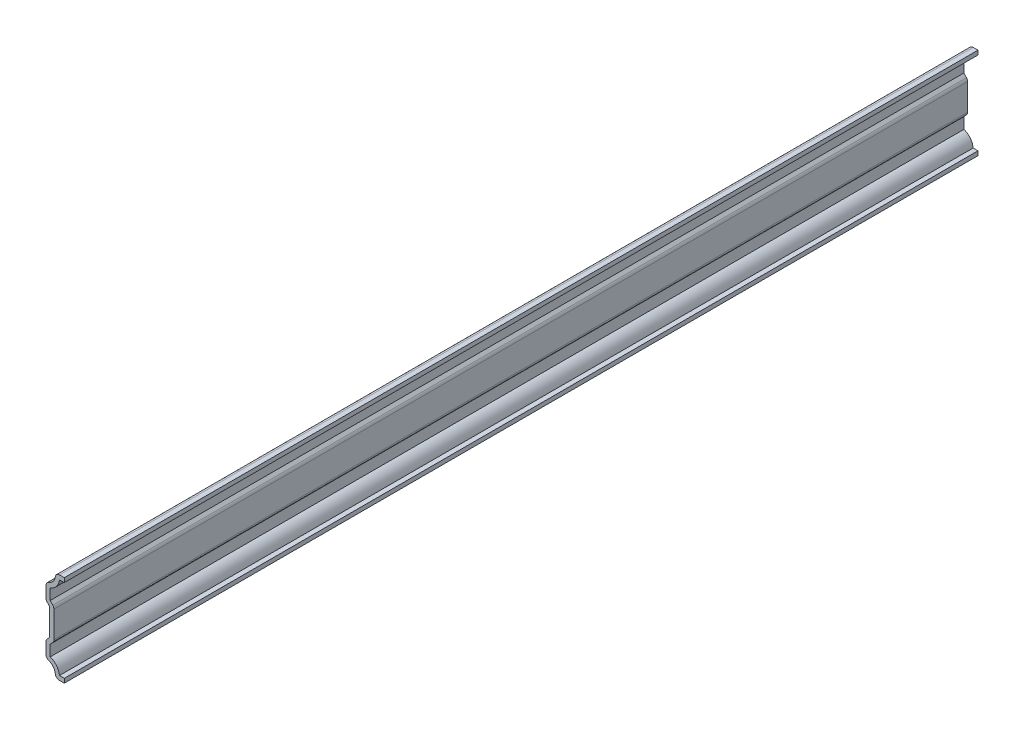
ISO-10303-21;
HEADER;
FILE_DESCRIPTION(('STEP AP214'),'2;1');
FILE_NAME('part.step','',(''),(''),'','','');
FILE_SCHEMA(('AUTOMOTIVE_DESIGN { 1 0 10303 214 1 1 1 1 }'));
ENDSEC;
DATA;
#1=APPLICATION_CONTEXT('core data for automotive mechanical design processes');
#2=APPLICATION_PROTOCOL_DEFINITION('international standard','automotive_design',2000,#1);
#3=PRODUCT_CONTEXT('',#1,'mechanical');
#4=PRODUCT('Part','Part','',(#3));
#5=PRODUCT_RELATED_PRODUCT_CATEGORY('part','',(#4));
#6=PRODUCT_DEFINITION_FORMATION('','',#4);
#7=PRODUCT_DEFINITION_CONTEXT('part definition',#1,'design');
#8=PRODUCT_DEFINITION('design','',#6,#7);
#9=PRODUCT_DEFINITION_SHAPE('','',#8);
#10=(LENGTH_UNIT() NAMED_UNIT(*) SI_UNIT(.MILLI.,.METRE.));
#11=(NAMED_UNIT(*) PLANE_ANGLE_UNIT() SI_UNIT($,.RADIAN.));
#12=(NAMED_UNIT(*) SI_UNIT($,.STERADIAN.) SOLID_ANGLE_UNIT());
#13=UNCERTAINTY_MEASURE_WITH_UNIT(LENGTH_MEASURE(1.E-05),#10,'distance_accuracy_value','');
#14=(GEOMETRIC_REPRESENTATION_CONTEXT(3) GLOBAL_UNCERTAINTY_ASSIGNED_CONTEXT((#13)) GLOBAL_UNIT_ASSIGNED_CONTEXT((#10,
#11,#12)) REPRESENTATION_CONTEXT('',''));
#15=CARTESIAN_POINT('',(0.,0.,0.));
#16=DIRECTION('',(0.,0.,1.));
#17=DIRECTION('',(1.,0.,0.));
#18=AXIS2_PLACEMENT_3D('',#15,#16,#17);
#19=CARTESIAN_POINT('',(0.,0.,-357.1875));
#20=DIRECTION('',(0.,-1.,0.));
#21=DIRECTION('',(0.,0.,-1.));
#22=AXIS2_PLACEMENT_3D('',#19,#20,#21);
#23=PLANE('',#22);
#24=DIRECTION('',(1.,0.,0.));
#25=VECTOR('',#24,1.);
#26=CARTESIAN_POINT('',(0.,0.,0.));
#27=LINE('',#26,#25);
#28=CARTESIAN_POINT('',(-1.88974825091168,0.,0.));
#29=VERTEX_POINT('',#28);
#30=CARTESIAN_POINT('',(0.,0.,0.));
#31=VERTEX_POINT('',#30);
#32=EDGE_CURVE('E394',#29,#31,#27,.T.);
#33=ORIENTED_EDGE('',*,*,#32,.F.);
#34=DIRECTION('',(0.,0.,1.));
#35=VECTOR('',#34,1.);
#36=CARTESIAN_POINT('',(-1.88974825091168,0.,-357.1875));
#37=LINE('',#36,#35);
#38=CARTESIAN_POINT('',(-1.88974825091168,0.,-357.1875));
#39=VERTEX_POINT('',#38);
#40=EDGE_CURVE('E229',#29,#39,#37,.F.);
#41=ORIENTED_EDGE('',*,*,#40,.T.);
#42=DIRECTION('',(1.,0.,0.));
#43=VECTOR('',#42,1.);
#44=CARTESIAN_POINT('',(0.,0.,-357.1875));
#45=LINE('',#44,#43);
#46=CARTESIAN_POINT('',(0.,0.,-357.1875));
#47=VERTEX_POINT('',#46);
#48=EDGE_CURVE('E222',#39,#47,#45,.T.);
#49=ORIENTED_EDGE('',*,*,#48,.T.);
#50=DIRECTION('',(0.,0.,1.));
#51=VECTOR('',#50,1.);
#52=CARTESIAN_POINT('',(0.,0.,-357.1875));
#53=LINE('',#52,#51);
#54=EDGE_CURVE('E226',#47,#31,#53,.T.);
#55=ORIENTED_EDGE('',*,*,#54,.T.);
#56=EDGE_LOOP('',(#33,#41,#49,#55));
#57=FACE_BOUND('',#56,.T.);
#58=ADVANCED_FACE('F35',(#57),#23,.T.);
#59=CARTESIAN_POINT('',(-7.14375,1.13413615439127,-357.1875));
#60=DIRECTION('',(0.,0.,1.));
#61=DIRECTION('',(1.,0.,0.));
#62=AXIS2_PLACEMENT_3D('',#59,#60,#61);
#63=CYLINDRICAL_SURFACE('',#62,3.62836384560873);
#64=CARTESIAN_POINT('',(-7.14375,1.13413615439127,-357.1875));
#65=DIRECTION('',(0.,0.,-1.));
#66=DIRECTION('',(1.,0.,0.));
#67=AXIS2_PLACEMENT_3D('',#64,#65,#66);
#68=CIRCLE('',#67,3.62836384560873);
#69=CARTESIAN_POINT('',(-6.00906239666636,4.58051225675757,-357.1875));
#70=VERTEX_POINT('',#69);
#71=CARTESIAN_POINT('',(-3.53281683671486,1.48936268269144,-357.1875));
#72=VERTEX_POINT('',#71);
#73=EDGE_CURVE('E246',#70,#72,#68,.T.);
#74=ORIENTED_EDGE('',*,*,#73,.T.);
#75=DIRECTION('',(0.,0.,1.));
#76=VECTOR('',#75,1.);
#77=CARTESIAN_POINT('',(-3.53281683671486,1.48936268269144,-357.1875));
#78=LINE('',#77,#76);
#79=CARTESIAN_POINT('',(-3.53281683671486,1.48936268269144,0.));
#80=VERTEX_POINT('',#79);
#81=EDGE_CURVE('E257',#72,#80,#78,.T.);
#82=ORIENTED_EDGE('',*,*,#81,.T.);
#83=CARTESIAN_POINT('',(-7.14375,1.13413615439127,0.));
#84=DIRECTION('',(0.,0.,-1.));
#85=DIRECTION('',(1.,0.,0.));
#86=AXIS2_PLACEMENT_3D('',#83,#84,#85);
#87=CIRCLE('',#86,3.62836384560873);
#88=CARTESIAN_POINT('',(-6.00906239666636,4.58051225675757,0.));
#89=VERTEX_POINT('',#88);
#90=EDGE_CURVE('E232',#89,#80,#87,.T.);
#91=ORIENTED_EDGE('',*,*,#90,.F.);
#92=DIRECTION('',(0.,0.,1.));
#93=VECTOR('',#92,1.);
#94=CARTESIAN_POINT('',(-6.00906239666636,4.58051225675757,-357.1875));
#95=LINE('',#94,#93);
#96=EDGE_CURVE('E255',#89,#70,#95,.F.);
#97=ORIENTED_EDGE('',*,*,#96,.T.);
#98=EDGE_LOOP('',(#74,#82,#91,#97));
#99=FACE_BOUND('',#98,.T.);
#100=ADVANCED_FACE('F470',(#99),#63,.F.);
#101=CARTESIAN_POINT('',(-7.14375,4.7625,-357.1875));
#102=DIRECTION('',(-1.,0.,0.));
#103=DIRECTION('',(0.,0.,1.));
#104=AXIS2_PLACEMENT_3D('',#101,#102,#103);
#105=PLANE('',#104);
#106=DIRECTION('',(0.,-1.,0.));
#107=VECTOR('',#106,1.);
#108=CARTESIAN_POINT('',(-7.14375,4.7625,-357.1875));
#109=LINE('',#108,#107);
#110=CARTESIAN_POINT('',(-7.14375,10.4694360726647,-357.1875));
#111=VERTEX_POINT('',#110);
#112=CARTESIAN_POINT('',(-7.14375,6.14870309624384,-357.1875));
#113=VERTEX_POINT('',#112);
#114=EDGE_CURVE('E251',#111,#113,#109,.T.);
#115=ORIENTED_EDGE('',*,*,#114,.T.);
#116=DIRECTION('',(0.,0.,1.));
#117=VECTOR('',#116,1.);
#118=CARTESIAN_POINT('',(-7.14375,6.14870309624384,-357.1875));
#119=LINE('',#118,#117);
#120=CARTESIAN_POINT('',(-7.14375,6.14870309624384,0.));
#121=VERTEX_POINT('',#120);
#122=EDGE_CURVE('E295',#113,#121,#119,.T.);
#123=ORIENTED_EDGE('',*,*,#122,.T.);
#124=DIRECTION('',(0.,-1.,0.));
#125=VECTOR('',#124,1.);
#126=CARTESIAN_POINT('',(-7.14375,4.7625,0.));
#127=LINE('',#126,#125);
#128=CARTESIAN_POINT('',(-7.14375,10.4694360726647,0.));
#129=VERTEX_POINT('',#128);
#130=EDGE_CURVE('E353',#129,#121,#127,.T.);
#131=ORIENTED_EDGE('',*,*,#130,.F.);
#132=DIRECTION('',(0.,0.,1.));
#133=VECTOR('',#132,1.);
#134=CARTESIAN_POINT('',(-7.14375,10.4694360726647,-357.1875));
#135=LINE('',#134,#133);
#136=EDGE_CURVE('E293',#129,#111,#135,.F.);
#137=ORIENTED_EDGE('',*,*,#136,.T.);
#138=EDGE_LOOP('',(#115,#123,#131,#137));
#139=FACE_BOUND('',#138,.T.);
#140=ADVANCED_FACE('F479',(#139),#105,.T.);
#141=CARTESIAN_POINT('',(-7.14375,11.1125,-357.1875));
#142=DIRECTION('',(-0.736548293480114,0.676384957972553,0.));
#143=DIRECTION('',(-0.676384957972553,-0.736548293480114,0.));
#144=AXIS2_PLACEMENT_3D('',#141,#142,#143);
#145=PLANE('',#144);
#146=DIRECTION('',(-0.676384957972553,-0.736548293480114,0.));
#147=VECTOR('',#146,1.);
#148=CARTESIAN_POINT('',(-7.14375,11.1125,-357.1875));
#149=LINE('',#148,#147);
#150=CARTESIAN_POINT('',(-5.715,12.6683349751953,-357.1875));
#151=VERTEX_POINT('',#150);
#152=CARTESIAN_POINT('',(-6.70879123253567,11.5861476382774,-357.1875));
#153=VERTEX_POINT('',#152);
#154=EDGE_CURVE('E460',#151,#153,#149,.T.);
#155=ORIENTED_EDGE('',*,*,#154,.T.);
#156=DIRECTION('',(0.,0.,1.));
#157=VECTOR('',#156,1.);
#158=CARTESIAN_POINT('',(-6.70879123253567,11.5861476382774,-357.1875));
#159=LINE('',#158,#157);
#160=CARTESIAN_POINT('',(-6.70879123253567,11.5861476382774,0.));
#161=VERTEX_POINT('',#160);
#162=EDGE_CURVE('E298',#153,#161,#159,.T.);
#163=ORIENTED_EDGE('',*,*,#162,.T.);
#164=DIRECTION('',(-0.676384957972553,-0.736548293480114,0.));
#165=VECTOR('',#164,1.);
#166=CARTESIAN_POINT('',(-7.14375,11.1125,0.));
#167=LINE('',#166,#165);
#168=CARTESIAN_POINT('',(-5.715,12.6683349751953,0.));
#169=VERTEX_POINT('',#168);
#170=EDGE_CURVE('E350',#169,#161,#167,.T.);
#171=ORIENTED_EDGE('',*,*,#170,.F.);
#172=DIRECTION('',(0.,0.,1.));
#173=VECTOR('',#172,1.);
#174=CARTESIAN_POINT('',(-5.715,12.6683349751953,-357.1875));
#175=LINE('',#174,#173);
#176=EDGE_CURVE('E258',#151,#169,#175,.T.);
#177=ORIENTED_EDGE('',*,*,#176,.F.);
#178=EDGE_LOOP('',(#155,#163,#171,#177));
#179=FACE_BOUND('',#178,.T.);
#180=ADVANCED_FACE('F488',(#179),#145,.T.);
#181=CARTESIAN_POINT('',(-5.715,12.6683349751953,-357.1875));
#182=DIRECTION('',(-1.,0.,0.));
#183=DIRECTION('',(0.,0.,1.));
#184=AXIS2_PLACEMENT_3D('',#181,#182,#183);
#185=PLANE('',#184);
#186=DIRECTION('',(0.,-1.,0.));
#187=VECTOR('',#186,1.);
#188=CARTESIAN_POINT('',(-5.715,12.6683349751953,0.));
#189=LINE('',#188,#187);
#190=CARTESIAN_POINT('',(-5.715,23.0504150248047,0.));
#191=VERTEX_POINT('',#190);
#192=EDGE_CURVE('E347',#191,#169,#189,.T.);
#193=ORIENTED_EDGE('',*,*,#192,.F.);
#194=DIRECTION('',(0.,0.,1.));
#195=VECTOR('',#194,1.);
#196=CARTESIAN_POINT('',(-5.715,23.0504150248047,-357.1875));
#197=LINE('',#196,#195);
#198=CARTESIAN_POINT('',(-5.715,23.0504150248047,-357.1875));
#199=VERTEX_POINT('',#198);
#200=EDGE_CURVE('E358',#199,#191,#197,.T.);
#201=ORIENTED_EDGE('',*,*,#200,.F.);
#202=DIRECTION('',(0.,-1.,0.));
#203=VECTOR('',#202,1.);
#204=CARTESIAN_POINT('',(-5.715,12.6683349751953,-357.1875));
#205=LINE('',#204,#203);
#206=EDGE_CURVE('E457',#199,#151,#205,.T.);
#207=ORIENTED_EDGE('',*,*,#206,.T.);
#208=ORIENTED_EDGE('',*,*,#176,.T.);
#209=EDGE_LOOP('',(#193,#201,#207,#208));
#210=FACE_BOUND('',#209,.T.);
#211=ADVANCED_FACE('F492',(#210),#185,.T.);
#212=CARTESIAN_POINT('',(-7.14375,24.60625,-357.1875));
#213=DIRECTION('',(-0.736548293480114,-0.676384957972553,0.));
#214=DIRECTION('',(0.676384957972553,-0.736548293480114,0.));
#215=AXIS2_PLACEMENT_3D('',#212,#213,#214);
#216=PLANE('',#215);
#217=DIRECTION('',(0.676384957972552,-0.736548293480114,0.));
#218=VECTOR('',#217,1.);
#219=CARTESIAN_POINT('',(-7.14375,24.60625,0.));
#220=LINE('',#219,#218);
#221=CARTESIAN_POINT('',(-6.70879123253567,24.1326023617226,0.));
#222=VERTEX_POINT('',#221);
#223=EDGE_CURVE('E340',#222,#191,#220,.T.);
#224=ORIENTED_EDGE('',*,*,#223,.F.);
#225=DIRECTION('',(0.,0.,1.));
#226=VECTOR('',#225,1.);
#227=CARTESIAN_POINT('',(-6.70879123253567,24.1326023617226,-357.1875));
#228=LINE('',#227,#226);
#229=CARTESIAN_POINT('',(-6.70879123253567,24.1326023617226,-357.1875));
#230=VERTEX_POINT('',#229);
#231=EDGE_CURVE('E315',#222,#230,#228,.F.);
#232=ORIENTED_EDGE('',*,*,#231,.T.);
#233=DIRECTION('',(0.676384957972552,-0.736548293480114,0.));
#234=VECTOR('',#233,1.);
#235=CARTESIAN_POINT('',(-7.14375,24.60625,-357.1875));
#236=LINE('',#235,#234);
#237=EDGE_CURVE('E455',#230,#199,#236,.T.);
#238=ORIENTED_EDGE('',*,*,#237,.T.);
#239=ORIENTED_EDGE('',*,*,#200,.T.);
#240=EDGE_LOOP('',(#224,#232,#238,#239));
#241=FACE_BOUND('',#240,.T.);
#242=ADVANCED_FACE('F506',(#241),#216,.T.);
#243=CARTESIAN_POINT('',(-7.14375,30.95625,-357.1875));
#244=DIRECTION('',(-1.,0.,0.));
#245=DIRECTION('',(0.,0.,1.));
#246=AXIS2_PLACEMENT_3D('',#243,#244,#245);
#247=PLANE('',#246);
#248=DIRECTION('',(0.,-1.,0.));
#249=VECTOR('',#248,1.);
#250=CARTESIAN_POINT('',(-7.14375,30.95625,-357.1875));
#251=LINE('',#250,#249);
#252=CARTESIAN_POINT('',(-7.14375,29.5700469037562,-357.1875));
#253=VERTEX_POINT('',#252);
#254=CARTESIAN_POINT('',(-7.14375,25.2493139273353,-357.1875));
#255=VERTEX_POINT('',#254);
#256=EDGE_CURVE('E452',#253,#255,#251,.T.);
#257=ORIENTED_EDGE('',*,*,#256,.T.);
#258=DIRECTION('',(0.,0.,1.));
#259=VECTOR('',#258,1.);
#260=CARTESIAN_POINT('',(-7.14375,25.2493139273353,-357.1875));
#261=LINE('',#260,#259);
#262=CARTESIAN_POINT('',(-7.14375,25.2493139273353,0.));
#263=VERTEX_POINT('',#262);
#264=EDGE_CURVE('E312',#255,#263,#261,.T.);
#265=ORIENTED_EDGE('',*,*,#264,.T.);
#266=DIRECTION('',(0.,-1.,0.));
#267=VECTOR('',#266,1.);
#268=CARTESIAN_POINT('',(-7.14375,30.95625,0.));
#269=LINE('',#268,#267);
#270=CARTESIAN_POINT('',(-7.14375,29.5700469037562,0.));
#271=VERTEX_POINT('',#270);
#272=EDGE_CURVE('E337',#271,#263,#269,.T.);
#273=ORIENTED_EDGE('',*,*,#272,.F.);
#274=DIRECTION('',(0.,0.,1.));
#275=VECTOR('',#274,1.);
#276=CARTESIAN_POINT('',(-7.14375,29.5700469037562,-357.1875));
#277=LINE('',#276,#275);
#278=EDGE_CURVE('E310',#271,#253,#277,.F.);
#279=ORIENTED_EDGE('',*,*,#278,.T.);
#280=EDGE_LOOP('',(#257,#265,#273,#279));
#281=FACE_BOUND('',#280,.T.);
#282=ADVANCED_FACE('F503',(#281),#247,.T.);
#283=CARTESIAN_POINT('',(-7.14375,34.5846138456087,-357.1875));
#284=DIRECTION('',(0.,0.,1.));
#285=DIRECTION('',(1.,0.,0.));
#286=AXIS2_PLACEMENT_3D('',#283,#284,#285);
#287=CYLINDRICAL_SURFACE('',#286,3.62836384560873);
#288=CARTESIAN_POINT('',(-7.14375,34.5846138456087,-357.1875));
#289=DIRECTION('',(0.,0.,-1.));
#290=DIRECTION('',(-1.,0.,0.));
#291=AXIS2_PLACEMENT_3D('',#288,#289,#290);
#292=CIRCLE('',#291,3.62836384560873);
#293=CARTESIAN_POINT('',(-3.53281683671486,34.2293873173086,-357.1875));
#294=VERTEX_POINT('',#293);
#295=CARTESIAN_POINT('',(-6.00906239666637,31.1382377432424,-357.1875));
#296=VERTEX_POINT('',#295);
#297=EDGE_CURVE('E328',#294,#296,#292,.T.);
#298=ORIENTED_EDGE('',*,*,#297,.T.);
#299=DIRECTION('',(0.,0.,1.));
#300=VECTOR('',#299,1.);
#301=CARTESIAN_POINT('',(-6.00906239666637,31.1382377432424,-357.1875));
#302=LINE('',#301,#300);
#303=CARTESIAN_POINT('',(-6.00906239666637,31.1382377432424,0.));
#304=VERTEX_POINT('',#303);
#305=EDGE_CURVE('E43',#296,#304,#302,.T.);
#306=ORIENTED_EDGE('',*,*,#305,.T.);
#307=CARTESIAN_POINT('',(-7.14375,34.5846138456087,0.));
#308=DIRECTION('',(0.,0.,-1.));
#309=DIRECTION('',(-1.,0.,0.));
#310=AXIS2_PLACEMENT_3D('',#307,#308,#309);
#311=CIRCLE('',#310,3.62836384560873);
#312=CARTESIAN_POINT('',(-3.53281683671486,34.2293873173086,0.));
#313=VERTEX_POINT('',#312);
#314=EDGE_CURVE('E325',#313,#304,#311,.T.);
#315=ORIENTED_EDGE('',*,*,#314,.F.);
#316=DIRECTION('',(0.,0.,1.));
#317=VECTOR('',#316,1.);
#318=CARTESIAN_POINT('',(-3.53281683671486,34.2293873173086,-357.1875));
#319=LINE('',#318,#317);
#320=EDGE_CURVE('E317',#313,#294,#319,.F.);
#321=ORIENTED_EDGE('',*,*,#320,.T.);
#322=EDGE_LOOP('',(#298,#306,#315,#321));
#323=FACE_BOUND('',#322,.T.);
#324=ADVANCED_FACE('F324',(#323),#287,.F.);
#325=CARTESIAN_POINT('',(0.,35.71875,-357.1875));
#326=DIRECTION('',(0.,1.,0.));
#327=DIRECTION('',(0.,0.,1.));
#328=AXIS2_PLACEMENT_3D('',#325,#326,#327);
#329=PLANE('',#328);
#330=DIRECTION('',(-1.,0.,0.));
#331=VECTOR('',#330,1.);
#332=CARTESIAN_POINT('',(0.,35.71875,-357.1875));
#333=LINE('',#332,#331);
#334=CARTESIAN_POINT('',(0.,35.71875,-357.1875));
#335=VERTEX_POINT('',#334);
#336=CARTESIAN_POINT('',(-1.88974825091168,35.71875,-357.1875));
#337=VERTEX_POINT('',#336);
#338=EDGE_CURVE('E448',#335,#337,#333,.T.);
#339=ORIENTED_EDGE('',*,*,#338,.T.);
#340=DIRECTION('',(0.,0.,1.));
#341=VECTOR('',#340,1.);
#342=CARTESIAN_POINT('',(-1.88974825091168,35.71875,-357.1875));
#343=LINE('',#342,#341);
#344=CARTESIAN_POINT('',(-1.88974825091168,35.71875,0.));
#345=VERTEX_POINT('',#344);
#346=EDGE_CURVE('E11',#337,#345,#343,.T.);
#347=ORIENTED_EDGE('',*,*,#346,.T.);
#348=DIRECTION('',(-1.,0.,0.));
#349=VECTOR('',#348,1.);
#350=CARTESIAN_POINT('',(0.,35.71875,0.));
#351=LINE('',#350,#349);
#352=CARTESIAN_POINT('',(0.,35.71875,0.));
#353=VERTEX_POINT('',#352);
#354=EDGE_CURVE('E338',#353,#345,#351,.T.);
#355=ORIENTED_EDGE('',*,*,#354,.F.);
#356=DIRECTION('',(0.,0.,1.));
#357=VECTOR('',#356,1.);
#358=CARTESIAN_POINT('',(0.,35.71875,-357.1875));
#359=LINE('',#358,#357);
#360=EDGE_CURVE('E361',#335,#353,#359,.T.);
#361=ORIENTED_EDGE('',*,*,#360,.F.);
#362=EDGE_LOOP('',(#339,#347,#355,#361));
#363=FACE_BOUND('',#362,.T.);
#364=ADVANCED_FACE('F549',(#363),#329,.T.);
#365=CARTESIAN_POINT('',(0.,35.71875,-357.1875));
#366=DIRECTION('',(-1.,0.,0.));
#367=DIRECTION('',(0.,0.,1.));
#368=AXIS2_PLACEMENT_3D('',#365,#366,#367);
#369=PLANE('',#368);
#370=DIRECTION('',(0.,-1.,0.));
#371=VECTOR('',#370,1.);
#372=CARTESIAN_POINT('',(0.,35.71875,0.));
#373=LINE('',#372,#371);
#374=CARTESIAN_POINT('',(0.,34.06775,0.));
#375=VERTEX_POINT('',#374);
#376=EDGE_CURVE('E342',#353,#375,#373,.T.);
#377=ORIENTED_EDGE('',*,*,#376,.T.);
#378=DIRECTION('',(0.,0.,1.));
#379=VECTOR('',#378,1.);
#380=CARTESIAN_POINT('',(0.,34.06775,-357.1875));
#381=LINE('',#380,#379);
#382=CARTESIAN_POINT('',(0.,34.06775,-357.1875));
#383=VERTEX_POINT('',#382);
#384=EDGE_CURVE('E363',#383,#375,#381,.T.);
#385=ORIENTED_EDGE('',*,*,#384,.F.);
#386=DIRECTION('',(0.,-1.,0.));
#387=VECTOR('',#386,1.);
#388=CARTESIAN_POINT('',(0.,35.71875,-357.1875));
#389=LINE('',#388,#387);
#390=EDGE_CURVE('E446',#335,#383,#389,.T.);
#391=ORIENTED_EDGE('',*,*,#390,.F.);
#392=ORIENTED_EDGE('',*,*,#360,.T.);
#393=EDGE_LOOP('',(#377,#385,#391,#392));
#394=FACE_BOUND('',#393,.T.);
#395=ADVANCED_FACE('F414',(#394),#369,.F.);
#396=CARTESIAN_POINT('',(0.,34.06775,-357.1875));
#397=DIRECTION('',(0.,1.,0.));
#398=DIRECTION('',(0.,0.,1.));
#399=AXIS2_PLACEMENT_3D('',#396,#397,#398);
#400=PLANE('',#399);
#401=DIRECTION('',(1.,0.,0.));
#402=VECTOR('',#401,1.);
#403=CARTESIAN_POINT('',(0.,34.06775,0.));
#404=LINE('',#403,#402);
#405=CARTESIAN_POINT('',(-1.88974825091168,34.06775,0.));
#406=VERTEX_POINT('',#405);
#407=EDGE_CURVE('E410',#375,#406,#404,.F.);
#408=ORIENTED_EDGE('',*,*,#407,.T.);
#409=DIRECTION('',(0.,0.,1.));
#410=VECTOR('',#409,1.);
#411=CARTESIAN_POINT('',(-1.88974825091168,34.06775,-357.1875));
#412=LINE('',#411,#410);
#413=CARTESIAN_POINT('',(-1.88974825091168,34.06775,-357.1875));
#414=VERTEX_POINT('',#413);
#415=EDGE_CURVE('E366',#414,#406,#412,.T.);
#416=ORIENTED_EDGE('',*,*,#415,.F.);
#417=DIRECTION('',(1.,0.,0.));
#418=VECTOR('',#417,1.);
#419=CARTESIAN_POINT('',(0.,34.06775,-357.1875));
#420=LINE('',#419,#418);
#421=EDGE_CURVE('E422',#383,#414,#420,.F.);
#422=ORIENTED_EDGE('',*,*,#421,.F.);
#423=ORIENTED_EDGE('',*,*,#384,.T.);
#424=EDGE_LOOP('',(#408,#416,#422,#423));
#425=FACE_BOUND('',#424,.T.);
#426=ADVANCED_FACE('F420',(#425),#400,.F.);
#427=CARTESIAN_POINT('',(-7.14375,34.5846138456087,-357.1875));
#428=DIRECTION('',(0.,0.,1.));
#429=DIRECTION('',(1.,0.,0.));
#430=AXIS2_PLACEMENT_3D('',#427,#428,#429);
#431=CYLINDRICAL_SURFACE('',#430,5.27936384560873);
#432=CARTESIAN_POINT('',(-7.14375,34.5846138456087,0.));
#433=DIRECTION('',(0.,0.,1.));
#434=DIRECTION('',(1.,0.,0.));
#435=AXIS2_PLACEMENT_3D('',#432,#433,#434);
#436=CIRCLE('',#435,5.27936384560873);
#437=CARTESIAN_POINT('',(-5.49275,29.5700469037562,0.));
#438=VERTEX_POINT('',#437);
#439=EDGE_CURVE('E408',#406,#438,#436,.F.);
#440=ORIENTED_EDGE('',*,*,#439,.T.);
#441=DIRECTION('',(0.,0.,1.));
#442=VECTOR('',#441,1.);
#443=CARTESIAN_POINT('',(-5.49275,29.5700469037562,-357.1875));
#444=LINE('',#443,#442);
#445=CARTESIAN_POINT('',(-5.49275,29.5700469037562,-357.1875));
#446=VERTEX_POINT('',#445);
#447=EDGE_CURVE('E369',#446,#438,#444,.T.);
#448=ORIENTED_EDGE('',*,*,#447,.F.);
#449=CARTESIAN_POINT('',(-7.14375,34.5846138456087,-357.1875));
#450=DIRECTION('',(0.,0.,1.));
#451=DIRECTION('',(1.,0.,0.));
#452=AXIS2_PLACEMENT_3D('',#449,#450,#451);
#453=CIRCLE('',#452,5.27936384560873);
#454=EDGE_CURVE('E437',#414,#446,#453,.F.);
#455=ORIENTED_EDGE('',*,*,#454,.F.);
#456=ORIENTED_EDGE('',*,*,#415,.T.);
#457=EDGE_LOOP('',(#440,#448,#455,#456));
#458=FACE_BOUND('',#457,.T.);
#459=ADVANCED_FACE('F428',(#458),#431,.T.);
#460=CARTESIAN_POINT('',(-5.49275,30.95625,-357.1875));
#461=DIRECTION('',(-1.,0.,0.));
#462=DIRECTION('',(0.,0.,1.));
#463=AXIS2_PLACEMENT_3D('',#460,#461,#462);
#464=PLANE('',#463);
#465=DIRECTION('',(0.,1.,0.));
#466=VECTOR('',#465,1.);
#467=CARTESIAN_POINT('',(-5.49275,30.95625,0.));
#468=LINE('',#467,#466);
#469=CARTESIAN_POINT('',(-5.49275,25.2493139273353,0.));
#470=VERTEX_POINT('',#469);
#471=EDGE_CURVE('E406',#438,#470,#468,.F.);
#472=ORIENTED_EDGE('',*,*,#471,.T.);
#473=DIRECTION('',(0.,0.,1.));
#474=VECTOR('',#473,1.);
#475=CARTESIAN_POINT('',(-5.49275,25.2493139273353,-357.1875));
#476=LINE('',#475,#474);
#477=CARTESIAN_POINT('',(-5.49275,25.2493139273353,-357.1875));
#478=VERTEX_POINT('',#477);
#479=EDGE_CURVE('E372',#478,#470,#476,.T.);
#480=ORIENTED_EDGE('',*,*,#479,.F.);
#481=DIRECTION('',(0.,1.,0.));
#482=VECTOR('',#481,1.);
#483=CARTESIAN_POINT('',(-5.49275,30.95625,-357.1875));
#484=LINE('',#483,#482);
#485=EDGE_CURVE('E434',#446,#478,#484,.F.);
#486=ORIENTED_EDGE('',*,*,#485,.F.);
#487=ORIENTED_EDGE('',*,*,#447,.T.);
#488=EDGE_LOOP('',(#472,#480,#486,#487));
#489=FACE_BOUND('',#488,.T.);
#490=ADVANCED_FACE('F432',(#489),#464,.F.);
#491=CARTESIAN_POINT('',(-5.92770876746433,25.7229615656127,-357.1875));
#492=DIRECTION('',(-0.736548293480114,-0.676384957972553,0.));
#493=DIRECTION('',(0.676384957972553,-0.736548293480114,0.));
#494=AXIS2_PLACEMENT_3D('',#491,#492,#493);
#495=PLANE('',#494);
#496=DIRECTION('',(0.676384957972553,-0.736548293480114,0.));
#497=VECTOR('',#496,1.);
#498=CARTESIAN_POINT('',(-5.92770876746433,25.7229615656127,0.));
#499=LINE('',#498,#497);
#500=CARTESIAN_POINT('',(-4.49895876746433,24.1671265904174,0.));
#501=VERTEX_POINT('',#500);
#502=EDGE_CURVE('E403',#470,#501,#499,.T.);
#503=ORIENTED_EDGE('',*,*,#502,.T.);
#504=DIRECTION('',(0.,0.,1.));
#505=VECTOR('',#504,1.);
#506=CARTESIAN_POINT('',(-4.49895876746433,24.1671265904174,-357.1875));
#507=LINE('',#506,#505);
#508=CARTESIAN_POINT('',(-4.49895876746433,24.1671265904174,-357.1875));
#509=VERTEX_POINT('',#508);
#510=EDGE_CURVE('E308',#501,#509,#507,.F.);
#511=ORIENTED_EDGE('',*,*,#510,.T.);
#512=DIRECTION('',(0.676384957972553,-0.736548293480114,0.));
#513=VECTOR('',#512,1.);
#514=CARTESIAN_POINT('',(-5.92770876746433,25.7229615656127,-357.1875));
#515=LINE('',#514,#513);
#516=EDGE_CURVE('E438',#478,#509,#515,.T.);
#517=ORIENTED_EDGE('',*,*,#516,.F.);
#518=ORIENTED_EDGE('',*,*,#479,.T.);
#519=EDGE_LOOP('',(#503,#511,#517,#518));
#520=FACE_BOUND('',#519,.T.);
#521=ADVANCED_FACE('F565',(#520),#495,.F.);
#522=CARTESIAN_POINT('',(-4.064,12.6683349751953,-357.1875));
#523=DIRECTION('',(-1.,0.,0.));
#524=DIRECTION('',(0.,0.,1.));
#525=AXIS2_PLACEMENT_3D('',#522,#523,#524);
#526=PLANE('',#525);
#527=DIRECTION('',(0.,1.,0.));
#528=VECTOR('',#527,1.);
#529=CARTESIAN_POINT('',(-4.064,12.6683349751953,0.));
#530=LINE('',#529,#528);
#531=CARTESIAN_POINT('',(-4.064,23.0504150248047,0.));
#532=VERTEX_POINT('',#531);
#533=CARTESIAN_POINT('',(-4.064,12.6683349751953,0.));
#534=VERTEX_POINT('',#533);
#535=EDGE_CURVE('E401',#532,#534,#530,.F.);
#536=ORIENTED_EDGE('',*,*,#535,.T.);
#537=DIRECTION('',(0.,0.,1.));
#538=VECTOR('',#537,1.);
#539=CARTESIAN_POINT('',(-4.064,12.6683349751953,-357.1875));
#540=LINE('',#539,#538);
#541=CARTESIAN_POINT('',(-4.064,12.6683349751953,-357.1875));
#542=VERTEX_POINT('',#541);
#543=EDGE_CURVE('E58',#534,#542,#540,.F.);
#544=ORIENTED_EDGE('',*,*,#543,.T.);
#545=DIRECTION('',(0.,1.,0.));
#546=VECTOR('',#545,1.);
#547=CARTESIAN_POINT('',(-4.064,12.6683349751953,-357.1875));
#548=LINE('',#547,#546);
#549=CARTESIAN_POINT('',(-4.064,23.0504150248047,-357.1875));
#550=VERTEX_POINT('',#549);
#551=EDGE_CURVE('E441',#550,#542,#548,.F.);
#552=ORIENTED_EDGE('',*,*,#551,.F.);
#553=DIRECTION('',(0.,0.,1.));
#554=VECTOR('',#553,1.);
#555=CARTESIAN_POINT('',(-4.064,23.0504150248047,-357.1875));
#556=LINE('',#555,#554);
#557=EDGE_CURVE('E304',#550,#532,#556,.T.);
#558=ORIENTED_EDGE('',*,*,#557,.T.);
#559=EDGE_LOOP('',(#536,#544,#552,#558));
#560=FACE_BOUND('',#559,.T.);
#561=ADVANCED_FACE('F568',(#560),#526,.F.);
#562=CARTESIAN_POINT('',(-5.92770876746433,9.99578843438731,-357.1875));
#563=DIRECTION('',(-0.736548293480114,0.676384957972553,0.));
#564=DIRECTION('',(-0.676384957972553,-0.736548293480114,0.));
#565=AXIS2_PLACEMENT_3D('',#562,#563,#564);
#566=PLANE('',#565);
#567=DIRECTION('',(-0.676384957972553,-0.736548293480114,0.));
#568=VECTOR('',#567,1.);
#569=CARTESIAN_POINT('',(-5.92770876746433,9.99578843438731,-357.1875));
#570=LINE('',#569,#568);
#571=CARTESIAN_POINT('',(-4.49895876746433,11.5516234095826,-357.1875));
#572=VERTEX_POINT('',#571);
#573=CARTESIAN_POINT('',(-5.49275,10.4694360726647,-357.1875));
#574=VERTEX_POINT('',#573);
#575=EDGE_CURVE('E774',#572,#574,#570,.T.);
#576=ORIENTED_EDGE('',*,*,#575,.F.);
#577=DIRECTION('',(0.,0.,1.));
#578=VECTOR('',#577,1.);
#579=CARTESIAN_POINT('',(-4.49895876746433,11.5516234095826,-357.1875));
#580=LINE('',#579,#578);
#581=CARTESIAN_POINT('',(-4.49895876746433,11.5516234095826,0.));
#582=VERTEX_POINT('',#581);
#583=EDGE_CURVE('E301',#572,#582,#580,.T.);
#584=ORIENTED_EDGE('',*,*,#583,.T.);
#585=DIRECTION('',(-0.676384957972553,-0.736548293480114,0.));
#586=VECTOR('',#585,1.);
#587=CARTESIAN_POINT('',(-5.92770876746433,9.99578843438731,0.));
#588=LINE('',#587,#586);
#589=CARTESIAN_POINT('',(-5.49275,10.4694360726647,0.));
#590=VERTEX_POINT('',#589);
#591=EDGE_CURVE('E399',#582,#590,#588,.T.);
#592=ORIENTED_EDGE('',*,*,#591,.T.);
#593=DIRECTION('',(0.,0.,1.));
#594=VECTOR('',#593,1.);
#595=CARTESIAN_POINT('',(-5.49275,10.4694360726647,-357.1875));
#596=LINE('',#595,#594);
#597=EDGE_CURVE('E375',#574,#590,#596,.T.);
#598=ORIENTED_EDGE('',*,*,#597,.F.);
#599=EDGE_LOOP('',(#576,#584,#592,#598));
#600=FACE_BOUND('',#599,.T.);
#601=ADVANCED_FACE('F572',(#600),#566,.F.);
#602=CARTESIAN_POINT('',(-5.49275,4.7625,-357.1875));
#603=DIRECTION('',(-1.,0.,0.));
#604=DIRECTION('',(0.,0.,1.));
#605=AXIS2_PLACEMENT_3D('',#602,#603,#604);
#606=PLANE('',#605);
#607=DIRECTION('',(0.,1.,0.));
#608=VECTOR('',#607,1.);
#609=CARTESIAN_POINT('',(-5.49275,4.7625,0.));
#610=LINE('',#609,#608);
#611=CARTESIAN_POINT('',(-5.49275,6.14870309624384,0.));
#612=VERTEX_POINT('',#611);
#613=EDGE_CURVE('E392',#590,#612,#610,.F.);
#614=ORIENTED_EDGE('',*,*,#613,.T.);
#615=DIRECTION('',(0.,0.,1.));
#616=VECTOR('',#615,1.);
#617=CARTESIAN_POINT('',(-5.49275,6.14870309624384,-357.1875));
#618=LINE('',#617,#616);
#619=CARTESIAN_POINT('',(-5.49275,6.14870309624384,-357.1875));
#620=VERTEX_POINT('',#619);
#621=EDGE_CURVE('E378',#620,#612,#618,.T.);
#622=ORIENTED_EDGE('',*,*,#621,.F.);
#623=DIRECTION('',(0.,1.,0.));
#624=VECTOR('',#623,1.);
#625=CARTESIAN_POINT('',(-5.49275,4.7625,-357.1875));
#626=LINE('',#625,#624);
#627=EDGE_CURVE('E769',#574,#620,#626,.F.);
#628=ORIENTED_EDGE('',*,*,#627,.F.);
#629=ORIENTED_EDGE('',*,*,#597,.T.);
#630=EDGE_LOOP('',(#614,#622,#628,#629));
#631=FACE_BOUND('',#630,.T.);
#632=ADVANCED_FACE('F575',(#631),#606,.F.);
#633=CARTESIAN_POINT('',(-7.14375,1.13413615439127,-357.1875));
#634=DIRECTION('',(0.,0.,1.));
#635=DIRECTION('',(1.,0.,0.));
#636=AXIS2_PLACEMENT_3D('',#633,#634,#635);
#637=CYLINDRICAL_SURFACE('',#636,5.27936384560873);
#638=CARTESIAN_POINT('',(-7.14375,1.13413615439127,0.));
#639=DIRECTION('',(0.,0.,1.));
#640=DIRECTION('',(1.,0.,0.));
#641=AXIS2_PLACEMENT_3D('',#638,#639,#640);
#642=CIRCLE('',#641,5.27936384560873);
#643=CARTESIAN_POINT('',(-1.88974825091168,1.651,0.));
#644=VERTEX_POINT('',#643);
#645=EDGE_CURVE('E390',#612,#644,#642,.F.);
#646=ORIENTED_EDGE('',*,*,#645,.T.);
#647=DIRECTION('',(0.,0.,1.));
#648=VECTOR('',#647,1.);
#649=CARTESIAN_POINT('',(-1.88974825091168,1.651,-357.1875));
#650=LINE('',#649,#648);
#651=CARTESIAN_POINT('',(-1.88974825091168,1.651,-357.1875));
#652=VERTEX_POINT('',#651);
#653=EDGE_CURVE('E248',#652,#644,#650,.T.);
#654=ORIENTED_EDGE('',*,*,#653,.F.);
#655=CARTESIAN_POINT('',(-7.14375,1.13413615439127,-357.1875));
#656=DIRECTION('',(0.,0.,1.));
#657=DIRECTION('',(1.,0.,0.));
#658=AXIS2_PLACEMENT_3D('',#655,#656,#657);
#659=CIRCLE('',#658,5.27936384560873);
#660=EDGE_CURVE('E767',#620,#652,#659,.F.);
#661=ORIENTED_EDGE('',*,*,#660,.F.);
#662=ORIENTED_EDGE('',*,*,#621,.T.);
#663=EDGE_LOOP('',(#646,#654,#661,#662));
#664=FACE_BOUND('',#663,.T.);
#665=ADVANCED_FACE('F579',(#664),#637,.T.);
#666=CARTESIAN_POINT('',(0.,1.651,-357.1875));
#667=DIRECTION('',(0.,-1.,0.));
#668=DIRECTION('',(0.,0.,-1.));
#669=AXIS2_PLACEMENT_3D('',#666,#667,#668);
#670=PLANE('',#669);
#671=DIRECTION('',(1.,0.,0.));
#672=VECTOR('',#671,1.);
#673=CARTESIAN_POINT('',(0.,1.651,0.));
#674=LINE('',#673,#672);
#675=CARTESIAN_POINT('',(0.,1.651,0.));
#676=VERTEX_POINT('',#675);
#677=EDGE_CURVE('E385',#644,#676,#674,.T.);
#678=ORIENTED_EDGE('',*,*,#677,.T.);
#679=DIRECTION('',(0.,0.,1.));
#680=VECTOR('',#679,1.);
#681=CARTESIAN_POINT('',(0.,1.651,-357.1875));
#682=LINE('',#681,#680);
#683=CARTESIAN_POINT('',(0.,1.651,-357.1875));
#684=VERTEX_POINT('',#683);
#685=EDGE_CURVE('E245',#684,#676,#682,.T.);
#686=ORIENTED_EDGE('',*,*,#685,.F.);
#687=DIRECTION('',(1.,0.,0.));
#688=VECTOR('',#687,1.);
#689=CARTESIAN_POINT('',(0.,1.651,-357.1875));
#690=LINE('',#689,#688);
#691=EDGE_CURVE('E237',#652,#684,#690,.T.);
#692=ORIENTED_EDGE('',*,*,#691,.F.);
#693=ORIENTED_EDGE('',*,*,#653,.T.);
#694=EDGE_LOOP('',(#678,#686,#692,#693));
#695=FACE_BOUND('',#694,.T.);
#696=ADVANCED_FACE('F384',(#695),#670,.F.);
#697=CARTESIAN_POINT('',(0.,1.651,-357.1875));
#698=DIRECTION('',(-1.,0.,0.));
#699=DIRECTION('',(0.,0.,1.));
#700=AXIS2_PLACEMENT_3D('',#697,#698,#699);
#701=PLANE('',#700);
#702=DIRECTION('',(0.,-1.,0.));
#703=VECTOR('',#702,1.);
#704=CARTESIAN_POINT('',(0.,1.651,0.));
#705=LINE('',#704,#703);
#706=EDGE_CURVE('E244',#676,#31,#705,.T.);
#707=ORIENTED_EDGE('',*,*,#706,.T.);
#708=ORIENTED_EDGE('',*,*,#54,.F.);
#709=DIRECTION('',(0.,-1.,0.));
#710=VECTOR('',#709,1.);
#711=CARTESIAN_POINT('',(0.,1.651,-357.1875));
#712=LINE('',#711,#710);
#713=EDGE_CURVE('E231',#684,#47,#712,.T.);
#714=ORIENTED_EDGE('',*,*,#713,.F.);
#715=ORIENTED_EDGE('',*,*,#685,.T.);
#716=EDGE_LOOP('',(#707,#708,#714,#715));
#717=FACE_BOUND('',#716,.T.);
#718=ADVANCED_FACE('F242',(#717),#701,.F.);
#719=CARTESIAN_POINT('',(-7.14375,1.13413615439127,-357.1875));
#720=DIRECTION('',(0.,0.,1.));
#721=DIRECTION('',(1.,0.,0.));
#722=AXIS2_PLACEMENT_3D('',#719,#720,#721);
#723=PLANE('',#722);
#724=ORIENTED_EDGE('',*,*,#48,.F.);
#725=CARTESIAN_POINT('',(-1.88974825091168,1.651,-357.1875));
#726=DIRECTION('',(0.,0.,1.));
#727=DIRECTION('',(1.,0.,0.));
#728=AXIS2_PLACEMENT_3D('',#725,#726,#727);
#729=CIRCLE('',#728,1.651);
#730=EDGE_CURVE('E291',#39,#72,#729,.F.);
#731=ORIENTED_EDGE('',*,*,#730,.T.);
#732=ORIENTED_EDGE('',*,*,#73,.F.);
#733=CARTESIAN_POINT('',(-5.49275,6.14870309624384,-357.1875));
#734=DIRECTION('',(0.,0.,1.));
#735=DIRECTION('',(1.,0.,0.));
#736=AXIS2_PLACEMENT_3D('',#733,#734,#735);
#737=CIRCLE('',#736,1.651);
#738=EDGE_CURVE('E289',#70,#113,#737,.F.);
#739=ORIENTED_EDGE('',*,*,#738,.T.);
#740=ORIENTED_EDGE('',*,*,#114,.F.);
#741=CARTESIAN_POINT('',(-5.49275,10.4694360726647,-357.1875));
#742=DIRECTION('',(0.,0.,1.));
#743=DIRECTION('',(1.,0.,0.));
#744=AXIS2_PLACEMENT_3D('',#741,#742,#743);
#745=CIRCLE('',#744,1.651);
#746=EDGE_CURVE('E287',#111,#153,#745,.F.);
#747=ORIENTED_EDGE('',*,*,#746,.T.);
#748=ORIENTED_EDGE('',*,*,#154,.F.);
#749=ORIENTED_EDGE('',*,*,#206,.F.);
#750=ORIENTED_EDGE('',*,*,#237,.F.);
#751=CARTESIAN_POINT('',(-5.49275,25.2493139273353,-357.1875));
#752=DIRECTION('',(0.,0.,1.));
#753=DIRECTION('',(1.,0.,0.));
#754=AXIS2_PLACEMENT_3D('',#751,#752,#753);
#755=CIRCLE('',#754,1.651);
#756=EDGE_CURVE('E282',#230,#255,#755,.F.);
#757=ORIENTED_EDGE('',*,*,#756,.T.);
#758=ORIENTED_EDGE('',*,*,#256,.F.);
#759=CARTESIAN_POINT('',(-5.49275,29.5700469037562,-357.1875));
#760=DIRECTION('',(0.,0.,1.));
#761=DIRECTION('',(1.,0.,0.));
#762=AXIS2_PLACEMENT_3D('',#759,#760,#761);
#763=CIRCLE('',#762,1.651);
#764=EDGE_CURVE('E280',#253,#296,#763,.F.);
#765=ORIENTED_EDGE('',*,*,#764,.T.);
#766=ORIENTED_EDGE('',*,*,#297,.F.);
#767=CARTESIAN_POINT('',(-1.88974825091168,34.06775,-357.1875));
#768=DIRECTION('',(0.,0.,1.));
#769=DIRECTION('',(1.,0.,0.));
#770=AXIS2_PLACEMENT_3D('',#767,#768,#769);
#771=CIRCLE('',#770,1.651);
#772=EDGE_CURVE('E278',#294,#337,#771,.F.);
#773=ORIENTED_EDGE('',*,*,#772,.T.);
#774=ORIENTED_EDGE('',*,*,#338,.F.);
#775=ORIENTED_EDGE('',*,*,#390,.T.);
#776=ORIENTED_EDGE('',*,*,#421,.T.);
#777=ORIENTED_EDGE('',*,*,#454,.T.);
#778=ORIENTED_EDGE('',*,*,#485,.T.);
#779=ORIENTED_EDGE('',*,*,#516,.T.);
#780=CARTESIAN_POINT('',(-5.715,23.0504150248047,-357.1875));
#781=DIRECTION('',(0.,0.,1.));
#782=DIRECTION('',(1.,0.,0.));
#783=AXIS2_PLACEMENT_3D('',#780,#781,#782);
#784=CIRCLE('',#783,1.651);
#785=EDGE_CURVE('E284',#509,#550,#784,.F.);
#786=ORIENTED_EDGE('',*,*,#785,.T.);
#787=ORIENTED_EDGE('',*,*,#551,.T.);
#788=CARTESIAN_POINT('',(-5.715,12.6683349751953,-357.1875));
#789=DIRECTION('',(0.,0.,1.));
#790=DIRECTION('',(1.,0.,0.));
#791=AXIS2_PLACEMENT_3D('',#788,#789,#790);
#792=CIRCLE('',#791,1.651);
#793=EDGE_CURVE('E50',#542,#572,#792,.F.);
#794=ORIENTED_EDGE('',*,*,#793,.T.);
#795=ORIENTED_EDGE('',*,*,#575,.T.);
#796=ORIENTED_EDGE('',*,*,#627,.T.);
#797=ORIENTED_EDGE('',*,*,#660,.T.);
#798=ORIENTED_EDGE('',*,*,#691,.T.);
#799=ORIENTED_EDGE('',*,*,#713,.T.);
#800=EDGE_LOOP('',(#724,#731,#732,#739,#740,#747,#748,#749,#750,#757,#758,#765,#766,#773,#774,
#775,#776,#777,#778,#779,#786,#787,#794,#795,#796,#797,#798,#799));
#801=FACE_BOUND('',#800,.T.);
#802=ADVANCED_FACE('F235',(#801),#723,.F.);
#803=CARTESIAN_POINT('',(-7.14375,1.13413615439127,0.));
#804=DIRECTION('',(0.,0.,1.));
#805=DIRECTION('',(1.,0.,0.));
#806=AXIS2_PLACEMENT_3D('',#803,#804,#805);
#807=PLANE('',#806);
#808=ORIENTED_EDGE('',*,*,#90,.T.);
#809=CARTESIAN_POINT('',(-1.88974825091168,1.651,0.));
#810=DIRECTION('',(0.,0.,1.));
#811=DIRECTION('',(1.,0.,0.));
#812=AXIS2_PLACEMENT_3D('',#809,#810,#811);
#813=CIRCLE('',#812,1.651);
#814=EDGE_CURVE('E275',#80,#29,#813,.T.);
#815=ORIENTED_EDGE('',*,*,#814,.T.);
#816=ORIENTED_EDGE('',*,*,#32,.T.);
#817=ORIENTED_EDGE('',*,*,#706,.F.);
#818=ORIENTED_EDGE('',*,*,#677,.F.);
#819=ORIENTED_EDGE('',*,*,#645,.F.);
#820=ORIENTED_EDGE('',*,*,#613,.F.);
#821=ORIENTED_EDGE('',*,*,#591,.F.);
#822=CARTESIAN_POINT('',(-5.715,12.6683349751953,0.));
#823=DIRECTION('',(0.,0.,1.));
#824=DIRECTION('',(1.,0.,0.));
#825=AXIS2_PLACEMENT_3D('',#822,#823,#824);
#826=CIRCLE('',#825,1.651);
#827=EDGE_CURVE('E269',#582,#534,#826,.T.);
#828=ORIENTED_EDGE('',*,*,#827,.T.);
#829=ORIENTED_EDGE('',*,*,#535,.F.);
#830=CARTESIAN_POINT('',(-5.715,23.0504150248047,0.));
#831=DIRECTION('',(0.,0.,1.));
#832=DIRECTION('',(1.,0.,0.));
#833=AXIS2_PLACEMENT_3D('',#830,#831,#832);
#834=CIRCLE('',#833,1.651);
#835=EDGE_CURVE('E267',#532,#501,#834,.T.);
#836=ORIENTED_EDGE('',*,*,#835,.T.);
#837=ORIENTED_EDGE('',*,*,#502,.F.);
#838=ORIENTED_EDGE('',*,*,#471,.F.);
#839=ORIENTED_EDGE('',*,*,#439,.F.);
#840=ORIENTED_EDGE('',*,*,#407,.F.);
#841=ORIENTED_EDGE('',*,*,#376,.F.);
#842=ORIENTED_EDGE('',*,*,#354,.T.);
#843=CARTESIAN_POINT('',(-1.88974825091168,34.06775,0.));
#844=DIRECTION('',(0.,0.,1.));
#845=DIRECTION('',(1.,0.,0.));
#846=AXIS2_PLACEMENT_3D('',#843,#844,#845);
#847=CIRCLE('',#846,1.651);
#848=EDGE_CURVE('E261',#345,#313,#847,.T.);
#849=ORIENTED_EDGE('',*,*,#848,.T.);
#850=ORIENTED_EDGE('',*,*,#314,.T.);
#851=CARTESIAN_POINT('',(-5.49275,29.5700469037562,0.));
#852=DIRECTION('',(0.,0.,1.));
#853=DIRECTION('',(1.,0.,0.));
#854=AXIS2_PLACEMENT_3D('',#851,#852,#853);
#855=CIRCLE('',#854,1.651);
#856=EDGE_CURVE('E263',#304,#271,#855,.T.);
#857=ORIENTED_EDGE('',*,*,#856,.T.);
#858=ORIENTED_EDGE('',*,*,#272,.T.);
#859=CARTESIAN_POINT('',(-5.49275,25.2493139273353,0.));
#860=DIRECTION('',(0.,0.,1.));
#861=DIRECTION('',(1.,0.,0.));
#862=AXIS2_PLACEMENT_3D('',#859,#860,#861);
#863=CIRCLE('',#862,1.651);
#864=EDGE_CURVE('E265',#263,#222,#863,.T.);
#865=ORIENTED_EDGE('',*,*,#864,.T.);
#866=ORIENTED_EDGE('',*,*,#223,.T.);
#867=ORIENTED_EDGE('',*,*,#192,.T.);
#868=ORIENTED_EDGE('',*,*,#170,.T.);
#869=CARTESIAN_POINT('',(-5.49275,10.4694360726647,0.));
#870=DIRECTION('',(0.,0.,1.));
#871=DIRECTION('',(1.,0.,0.));
#872=AXIS2_PLACEMENT_3D('',#869,#870,#871);
#873=CIRCLE('',#872,1.651);
#874=EDGE_CURVE('E271',#161,#129,#873,.T.);
#875=ORIENTED_EDGE('',*,*,#874,.T.);
#876=ORIENTED_EDGE('',*,*,#130,.T.);
#877=CARTESIAN_POINT('',(-5.49275,6.14870309624384,0.));
#878=DIRECTION('',(0.,0.,1.));
#879=DIRECTION('',(1.,0.,0.));
#880=AXIS2_PLACEMENT_3D('',#877,#878,#879);
#881=CIRCLE('',#880,1.651);
#882=EDGE_CURVE('E273',#121,#89,#881,.T.);
#883=ORIENTED_EDGE('',*,*,#882,.T.);
#884=EDGE_LOOP('',(#808,#815,#816,#817,#818,#819,#820,#821,#828,#829,#836,#837,#838,#839,#840,
#841,#842,#849,#850,#857,#858,#865,#866,#867,#868,#875,#876,#883));
#885=FACE_BOUND('',#884,.T.);
#886=ADVANCED_FACE('F333',(#885),#807,.T.);
#887=CARTESIAN_POINT('',(-1.88974825091168,1.651,-357.1875));
#888=DIRECTION('',(0.,0.,1.));
#889=DIRECTION('',(1.,0.,0.));
#890=AXIS2_PLACEMENT_3D('',#887,#888,#889);
#891=CYLINDRICAL_SURFACE('',#890,1.651);
#892=ORIENTED_EDGE('',*,*,#730,.F.);
#893=ORIENTED_EDGE('',*,*,#40,.F.);
#894=ORIENTED_EDGE('',*,*,#814,.F.);
#895=ORIENTED_EDGE('',*,*,#81,.F.);
#896=EDGE_LOOP('',(#892,#893,#894,#895));
#897=FACE_BOUND('',#896,.T.);
#898=ADVANCED_FACE('F465',(#897),#891,.T.);
#899=CARTESIAN_POINT('',(-5.49275,6.14870309624384,-357.1875));
#900=DIRECTION('',(0.,0.,1.));
#901=DIRECTION('',(1.,0.,0.));
#902=AXIS2_PLACEMENT_3D('',#899,#900,#901);
#903=CYLINDRICAL_SURFACE('',#902,1.651);
#904=ORIENTED_EDGE('',*,*,#738,.F.);
#905=ORIENTED_EDGE('',*,*,#96,.F.);
#906=ORIENTED_EDGE('',*,*,#882,.F.);
#907=ORIENTED_EDGE('',*,*,#122,.F.);
#908=EDGE_LOOP('',(#904,#905,#906,#907));
#909=FACE_BOUND('',#908,.T.);
#910=ADVANCED_FACE('F474',(#909),#903,.T.);
#911=CARTESIAN_POINT('',(-5.49275,10.4694360726647,-357.1875));
#912=DIRECTION('',(0.,0.,1.));
#913=DIRECTION('',(1.,0.,0.));
#914=AXIS2_PLACEMENT_3D('',#911,#912,#913);
#915=CYLINDRICAL_SURFACE('',#914,1.651);
#916=ORIENTED_EDGE('',*,*,#746,.F.);
#917=ORIENTED_EDGE('',*,*,#136,.F.);
#918=ORIENTED_EDGE('',*,*,#874,.F.);
#919=ORIENTED_EDGE('',*,*,#162,.F.);
#920=EDGE_LOOP('',(#916,#917,#918,#919));
#921=FACE_BOUND('',#920,.T.);
#922=ADVANCED_FACE('F483',(#921),#915,.T.);
#923=CARTESIAN_POINT('',(-5.715,12.6683349751953,-357.1875));
#924=DIRECTION('',(0.,0.,1.));
#925=DIRECTION('',(1.,0.,0.));
#926=AXIS2_PLACEMENT_3D('',#923,#924,#925);
#927=CYLINDRICAL_SURFACE('',#926,1.651);
#928=ORIENTED_EDGE('',*,*,#793,.F.);
#929=ORIENTED_EDGE('',*,*,#543,.F.);
#930=ORIENTED_EDGE('',*,*,#827,.F.);
#931=ORIENTED_EDGE('',*,*,#583,.F.);
#932=EDGE_LOOP('',(#928,#929,#930,#931));
#933=FACE_BOUND('',#932,.T.);
#934=ADVANCED_FACE('F530',(#933),#927,.T.);
#935=CARTESIAN_POINT('',(-5.715,23.0504150248047,-357.1875));
#936=DIRECTION('',(0.,0.,1.));
#937=DIRECTION('',(1.,0.,0.));
#938=AXIS2_PLACEMENT_3D('',#935,#936,#937);
#939=CYLINDRICAL_SURFACE('',#938,1.651);
#940=ORIENTED_EDGE('',*,*,#785,.F.);
#941=ORIENTED_EDGE('',*,*,#510,.F.);
#942=ORIENTED_EDGE('',*,*,#835,.F.);
#943=ORIENTED_EDGE('',*,*,#557,.F.);
#944=EDGE_LOOP('',(#940,#941,#942,#943));
#945=FACE_BOUND('',#944,.T.);
#946=ADVANCED_FACE('F533',(#945),#939,.T.);
#947=CARTESIAN_POINT('',(-5.49275,25.2493139273353,-357.1875));
#948=DIRECTION('',(0.,0.,1.));
#949=DIRECTION('',(1.,0.,0.));
#950=AXIS2_PLACEMENT_3D('',#947,#948,#949);
#951=CYLINDRICAL_SURFACE('',#950,1.651);
#952=ORIENTED_EDGE('',*,*,#756,.F.);
#953=ORIENTED_EDGE('',*,*,#231,.F.);
#954=ORIENTED_EDGE('',*,*,#864,.F.);
#955=ORIENTED_EDGE('',*,*,#264,.F.);
#956=EDGE_LOOP('',(#952,#953,#954,#955));
#957=FACE_BOUND('',#956,.T.);
#958=ADVANCED_FACE('F501',(#957),#951,.T.);
#959=CARTESIAN_POINT('',(-5.49275,29.5700469037562,-357.1875));
#960=DIRECTION('',(0.,0.,1.));
#961=DIRECTION('',(1.,0.,0.));
#962=AXIS2_PLACEMENT_3D('',#959,#960,#961);
#963=CYLINDRICAL_SURFACE('',#962,1.651);
#964=ORIENTED_EDGE('',*,*,#764,.F.);
#965=ORIENTED_EDGE('',*,*,#278,.F.);
#966=ORIENTED_EDGE('',*,*,#856,.F.);
#967=ORIENTED_EDGE('',*,*,#305,.F.);
#968=EDGE_LOOP('',(#964,#965,#966,#967));
#969=FACE_BOUND('',#968,.T.);
#970=ADVANCED_FACE('F539',(#969),#963,.T.);
#971=CARTESIAN_POINT('',(-1.88974825091168,34.06775,-357.1875));
#972=DIRECTION('',(0.,0.,1.));
#973=DIRECTION('',(1.,0.,0.));
#974=AXIS2_PLACEMENT_3D('',#971,#972,#973);
#975=CYLINDRICAL_SURFACE('',#974,1.651);
#976=ORIENTED_EDGE('',*,*,#772,.F.);
#977=ORIENTED_EDGE('',*,*,#320,.F.);
#978=ORIENTED_EDGE('',*,*,#848,.F.);
#979=ORIENTED_EDGE('',*,*,#346,.F.);
#980=EDGE_LOOP('',(#976,#977,#978,#979));
#981=FACE_BOUND('',#980,.T.);
#982=ADVANCED_FACE('F37',(#981),#975,.T.);
#983=CLOSED_SHELL('',(#58,#100,#140,#180,#211,#242,#282,#324,#364,#395,#426,#459,#490,#521,#561,
#601,#632,#665,#696,#718,#802,#886,#898,#910,#922,#934,#946,#958,#970,#982));
#984=MANIFOLD_SOLID_BREP('B2',#983);
#985=ADVANCED_BREP_SHAPE_REPRESENTATION('',(#18,#984),#14);
#986=SHAPE_DEFINITION_REPRESENTATION(#9,#985);
ENDSEC;
END-ISO-10303-21;
